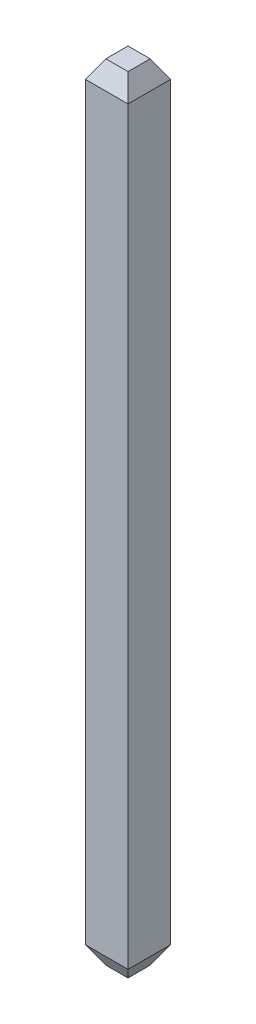
ISO-10303-21;
HEADER;
FILE_DESCRIPTION(('STEP AP214'),'2;1');
FILE_NAME('part.step','',(''),(''),'','','');
FILE_SCHEMA(('AUTOMOTIVE_DESIGN { 1 0 10303 214 1 1 1 1 }'));
ENDSEC;
DATA;
#1=APPLICATION_CONTEXT('core data for automotive mechanical design processes');
#2=APPLICATION_PROTOCOL_DEFINITION('international standard','automotive_design',2000,#1);
#3=PRODUCT_CONTEXT('',#1,'mechanical');
#4=PRODUCT('Part','Part','',(#3));
#5=PRODUCT_RELATED_PRODUCT_CATEGORY('part','',(#4));
#6=PRODUCT_DEFINITION_FORMATION('','',#4);
#7=PRODUCT_DEFINITION_CONTEXT('part definition',#1,'design');
#8=PRODUCT_DEFINITION('design','',#6,#7);
#9=PRODUCT_DEFINITION_SHAPE('','',#8);
#10=(LENGTH_UNIT() NAMED_UNIT(*) SI_UNIT(.MILLI.,.METRE.));
#11=(NAMED_UNIT(*) PLANE_ANGLE_UNIT() SI_UNIT($,.RADIAN.));
#12=(NAMED_UNIT(*) SI_UNIT($,.STERADIAN.) SOLID_ANGLE_UNIT());
#13=UNCERTAINTY_MEASURE_WITH_UNIT(LENGTH_MEASURE(1.E-05),#10,'distance_accuracy_value','');
#14=(GEOMETRIC_REPRESENTATION_CONTEXT(3) GLOBAL_UNCERTAINTY_ASSIGNED_CONTEXT((#13)) GLOBAL_UNIT_ASSIGNED_CONTEXT((#10,
#11,#12)) REPRESENTATION_CONTEXT('',''));
#15=CARTESIAN_POINT('',(0.,0.,0.));
#16=DIRECTION('',(0.,0.,1.));
#17=DIRECTION('',(1.,0.,0.));
#18=AXIS2_PLACEMENT_3D('',#15,#16,#17);
#19=CARTESIAN_POINT('',(7.3025,-5.58,1.105));
#20=DIRECTION('',(0.,0.50000000000019,0.866025403784329));
#21=DIRECTION('',(1.,0.,0.));
#22=AXIS2_PLACEMENT_3D('',#19,#20,#21);
#23=PLANE('',#22);
#24=DIRECTION('',(-0.44721359550015,0.774596669241261,-0.44721359550015));
#25=VECTOR('',#24,1.);
#26=CARTESIAN_POINT('',(7.455,-5.58,1.105));
#27=LINE('',#26,#25);
#28=CARTESIAN_POINT('',(7.455,-5.58,1.105));
#29=VERTEX_POINT('',#28);
#30=CARTESIAN_POINT('',(7.3025,-5.31586225185,0.9525));
#31=VERTEX_POINT('',#30);
#32=EDGE_CURVE('E91',#29,#31,#27,.T.);
#33=ORIENTED_EDGE('',*,*,#32,.T.);
#34=DIRECTION('',(1.,0.,0.));
#35=VECTOR('',#34,1.);
#36=CARTESIAN_POINT('',(7.3025,-5.31586225185,0.9525));
#37=LINE('',#36,#35);
#38=CARTESIAN_POINT('',(7.9375,-5.31586225185,0.9525));
#39=VERTEX_POINT('',#38);
#40=EDGE_CURVE('E94',#31,#39,#37,.T.);
#41=ORIENTED_EDGE('',*,*,#40,.T.);
#42=DIRECTION('',(0.44721359550015,0.774596669241261,-0.44721359550015));
#43=VECTOR('',#42,1.);
#44=CARTESIAN_POINT('',(7.785,-5.58,1.105));
#45=LINE('',#44,#43);
#46=CARTESIAN_POINT('',(7.785,-5.58,1.105));
#47=VERTEX_POINT('',#46);
#48=EDGE_CURVE('E27',#47,#39,#45,.T.);
#49=ORIENTED_EDGE('',*,*,#48,.F.);
#50=DIRECTION('',(1.,0.,0.));
#51=VECTOR('',#50,1.);
#52=CARTESIAN_POINT('',(7.455,-5.58,1.105));
#53=LINE('',#52,#51);
#54=EDGE_CURVE('E97',#29,#47,#53,.T.);
#55=ORIENTED_EDGE('',*,*,#54,.F.);
#56=EDGE_LOOP('',(#33,#41,#49,#55));
#57=FACE_BOUND('',#56,.T.);
#58=ADVANCED_FACE('F16',(#57),#23,.F.);
#59=CARTESIAN_POINT('',(7.9375,-5.58,1.435));
#60=DIRECTION('',(0.,0.50000000000019,-0.866025403784329));
#61=DIRECTION('',(-1.,0.,0.));
#62=AXIS2_PLACEMENT_3D('',#59,#60,#61);
#63=PLANE('',#62);
#64=DIRECTION('',(0.44721359550015,0.774596669241261,0.44721359550015));
#65=VECTOR('',#64,1.);
#66=CARTESIAN_POINT('',(7.785,-5.58,1.435));
#67=LINE('',#66,#65);
#68=CARTESIAN_POINT('',(7.785,-5.58,1.435));
#69=VERTEX_POINT('',#68);
#70=CARTESIAN_POINT('',(7.9375,-5.31586225185,1.5875));
#71=VERTEX_POINT('',#70);
#72=EDGE_CURVE('E11',#69,#71,#67,.T.);
#73=ORIENTED_EDGE('',*,*,#72,.T.);
#74=DIRECTION('',(-1.,0.,0.));
#75=VECTOR('',#74,1.);
#76=CARTESIAN_POINT('',(7.9375,-5.31586225185,1.5875));
#77=LINE('',#76,#75);
#78=CARTESIAN_POINT('',(7.3025,-5.31586225185,1.5875));
#79=VERTEX_POINT('',#78);
#80=EDGE_CURVE('E136',#71,#79,#77,.T.);
#81=ORIENTED_EDGE('',*,*,#80,.T.);
#82=DIRECTION('',(-0.44721359550015,0.774596669241261,0.44721359550015));
#83=VECTOR('',#82,1.);
#84=CARTESIAN_POINT('',(7.455,-5.58,1.435));
#85=LINE('',#84,#83);
#86=CARTESIAN_POINT('',(7.455,-5.58,1.435));
#87=VERTEX_POINT('',#86);
#88=EDGE_CURVE('E103',#87,#79,#85,.T.);
#89=ORIENTED_EDGE('',*,*,#88,.F.);
#90=DIRECTION('',(-1.,0.,0.));
#91=VECTOR('',#90,1.);
#92=CARTESIAN_POINT('',(7.785,-5.58,1.435));
#93=LINE('',#92,#91);
#94=EDGE_CURVE('E157',#69,#87,#93,.T.);
#95=ORIENTED_EDGE('',*,*,#94,.F.);
#96=EDGE_LOOP('',(#73,#81,#89,#95));
#97=FACE_BOUND('',#96,.T.);
#98=ADVANCED_FACE('F255',(#97),#63,.F.);
#99=CARTESIAN_POINT('',(7.785,-5.58,0.9525));
#100=DIRECTION('',(-0.866025403784329,0.50000000000019,0.));
#101=DIRECTION('',(0.,0.,1.));
#102=AXIS2_PLACEMENT_3D('',#99,#100,#101);
#103=PLANE('',#102);
#104=ORIENTED_EDGE('',*,*,#48,.T.);
#105=DIRECTION('',(0.,0.,1.));
#106=VECTOR('',#105,1.);
#107=CARTESIAN_POINT('',(7.9375,-5.31586225185,0.9525));
#108=LINE('',#107,#106);
#109=EDGE_CURVE('E133',#39,#71,#108,.T.);
#110=ORIENTED_EDGE('',*,*,#109,.T.);
#111=ORIENTED_EDGE('',*,*,#72,.F.);
#112=DIRECTION('',(0.,0.,1.));
#113=VECTOR('',#112,1.);
#114=CARTESIAN_POINT('',(7.785,-5.58,1.105));
#115=LINE('',#114,#113);
#116=EDGE_CURVE('E143',#47,#69,#115,.T.);
#117=ORIENTED_EDGE('',*,*,#116,.F.);
#118=EDGE_LOOP('',(#104,#110,#111,#117));
#119=FACE_BOUND('',#118,.T.);
#120=ADVANCED_FACE('F249',(#119),#103,.F.);
#121=CARTESIAN_POINT('',(7.62,-5.58,1.27));
#122=DIRECTION('',(0.,-1.,0.));
#123=DIRECTION('',(0.,0.,-1.));
#124=AXIS2_PLACEMENT_3D('',#121,#122,#123);
#125=PLANE('',#124);
#126=ORIENTED_EDGE('',*,*,#94,.T.);
#127=DIRECTION('',(0.,0.,-1.));
#128=VECTOR('',#127,1.);
#129=CARTESIAN_POINT('',(7.455,-5.58,1.435));
#130=LINE('',#129,#128);
#131=EDGE_CURVE('E102',#87,#29,#130,.T.);
#132=ORIENTED_EDGE('',*,*,#131,.T.);
#133=ORIENTED_EDGE('',*,*,#54,.T.);
#134=ORIENTED_EDGE('',*,*,#116,.T.);
#135=EDGE_LOOP('',(#126,#132,#133,#134));
#136=FACE_BOUND('',#135,.T.);
#137=ADVANCED_FACE('F254',(#136),#125,.T.);
#138=CARTESIAN_POINT('',(7.455,-5.58,1.5875));
#139=DIRECTION('',(0.866025403784329,0.50000000000019,0.));
#140=DIRECTION('',(0.,0.,-1.));
#141=AXIS2_PLACEMENT_3D('',#138,#139,#140);
#142=PLANE('',#141);
#143=ORIENTED_EDGE('',*,*,#88,.T.);
#144=DIRECTION('',(0.,0.,-1.));
#145=VECTOR('',#144,1.);
#146=CARTESIAN_POINT('',(7.3025,-5.31586225185,1.5875));
#147=LINE('',#146,#145);
#148=EDGE_CURVE('E106',#79,#31,#147,.T.);
#149=ORIENTED_EDGE('',*,*,#148,.T.);
#150=ORIENTED_EDGE('',*,*,#32,.F.);
#151=ORIENTED_EDGE('',*,*,#131,.F.);
#152=EDGE_LOOP('',(#143,#149,#150,#151));
#153=FACE_BOUND('',#152,.T.);
#154=ADVANCED_FACE('F108',(#153),#142,.F.);
#155=CARTESIAN_POINT('',(7.3025,6.1,1.5875));
#156=DIRECTION('',(-1.,0.,0.));
#157=DIRECTION('',(0.,0.,1.));
#158=AXIS2_PLACEMENT_3D('',#155,#156,#157);
#159=PLANE('',#158);
#160=DIRECTION('',(0.,-1.,0.));
#161=VECTOR('',#160,1.);
#162=CARTESIAN_POINT('',(7.3025,5.835862251846,0.9525));
#163=LINE('',#162,#161);
#164=CARTESIAN_POINT('',(7.3025,5.835862251846,0.9525));
#165=VERTEX_POINT('',#164);
#166=EDGE_CURVE('E113',#165,#31,#163,.T.);
#167=ORIENTED_EDGE('',*,*,#166,.T.);
#168=ORIENTED_EDGE('',*,*,#148,.F.);
#169=DIRECTION('',(0.,-1.,0.));
#170=VECTOR('',#169,1.);
#171=CARTESIAN_POINT('',(7.3025,5.835862251846,1.5875));
#172=LINE('',#171,#170);
#173=CARTESIAN_POINT('',(7.3025,5.835862251846,1.5875));
#174=VERTEX_POINT('',#173);
#175=EDGE_CURVE('E140',#174,#79,#172,.T.);
#176=ORIENTED_EDGE('',*,*,#175,.F.);
#177=DIRECTION('',(0.,0.,-1.));
#178=VECTOR('',#177,1.);
#179=CARTESIAN_POINT('',(7.3025,5.835862251846,1.5875));
#180=LINE('',#179,#178);
#181=EDGE_CURVE('E118',#174,#165,#180,.T.);
#182=ORIENTED_EDGE('',*,*,#181,.T.);
#183=EDGE_LOOP('',(#167,#168,#176,#182));
#184=FACE_BOUND('',#183,.T.);
#185=ADVANCED_FACE('F116',(#184),#159,.T.);
#186=CARTESIAN_POINT('',(7.3025,6.1,0.9525));
#187=DIRECTION('',(0.,0.,-1.));
#188=DIRECTION('',(0.,-1.,0.));
#189=AXIS2_PLACEMENT_3D('',#186,#187,#188);
#190=PLANE('',#189);
#191=DIRECTION('',(0.,-1.,0.));
#192=VECTOR('',#191,1.);
#193=CARTESIAN_POINT('',(7.9375,5.835862251846,0.9525));
#194=LINE('',#193,#192);
#195=CARTESIAN_POINT('',(7.9375,5.835862251846,0.9525));
#196=VERTEX_POINT('',#195);
#197=EDGE_CURVE('E20',#196,#39,#194,.T.);
#198=ORIENTED_EDGE('',*,*,#197,.T.);
#199=ORIENTED_EDGE('',*,*,#40,.F.);
#200=ORIENTED_EDGE('',*,*,#166,.F.);
#201=DIRECTION('',(1.,0.,0.));
#202=VECTOR('',#201,1.);
#203=CARTESIAN_POINT('',(7.3025,5.835862251846,0.9525));
#204=LINE('',#203,#202);
#205=EDGE_CURVE('E150',#165,#196,#204,.T.);
#206=ORIENTED_EDGE('',*,*,#205,.T.);
#207=EDGE_LOOP('',(#198,#199,#200,#206));
#208=FACE_BOUND('',#207,.T.);
#209=ADVANCED_FACE('F124',(#208),#190,.T.);
#210=CARTESIAN_POINT('',(7.9375,6.1,0.9525));
#211=DIRECTION('',(1.,0.,0.));
#212=DIRECTION('',(0.,1.,0.));
#213=AXIS2_PLACEMENT_3D('',#210,#211,#212);
#214=PLANE('',#213);
#215=DIRECTION('',(0.,-1.,0.));
#216=VECTOR('',#215,1.);
#217=CARTESIAN_POINT('',(7.9375,5.835862251846,1.5875));
#218=LINE('',#217,#216);
#219=CARTESIAN_POINT('',(7.9375,5.835862251846,1.5875));
#220=VERTEX_POINT('',#219);
#221=EDGE_CURVE('E139',#220,#71,#218,.T.);
#222=ORIENTED_EDGE('',*,*,#221,.T.);
#223=ORIENTED_EDGE('',*,*,#109,.F.);
#224=ORIENTED_EDGE('',*,*,#197,.F.);
#225=DIRECTION('',(0.,0.,1.));
#226=VECTOR('',#225,1.);
#227=CARTESIAN_POINT('',(7.9375,5.835862251846,0.9525));
#228=LINE('',#227,#226);
#229=EDGE_CURVE('E147',#196,#220,#228,.T.);
#230=ORIENTED_EDGE('',*,*,#229,.T.);
#231=EDGE_LOOP('',(#222,#223,#224,#230));
#232=FACE_BOUND('',#231,.T.);
#233=ADVANCED_FACE('F211',(#232),#214,.T.);
#234=CARTESIAN_POINT('',(7.9375,6.1,1.5875));
#235=DIRECTION('',(0.,0.,1.));
#236=DIRECTION('',(1.,0.,0.));
#237=AXIS2_PLACEMENT_3D('',#234,#235,#236);
#238=PLANE('',#237);
#239=ORIENTED_EDGE('',*,*,#175,.T.);
#240=ORIENTED_EDGE('',*,*,#80,.F.);
#241=ORIENTED_EDGE('',*,*,#221,.F.);
#242=DIRECTION('',(-1.,0.,0.));
#243=VECTOR('',#242,1.);
#244=CARTESIAN_POINT('',(7.9375,5.835862251846,1.5875));
#245=LINE('',#244,#243);
#246=EDGE_CURVE('E166',#220,#174,#245,.T.);
#247=ORIENTED_EDGE('',*,*,#246,.T.);
#248=EDGE_LOOP('',(#239,#240,#241,#247));
#249=FACE_BOUND('',#248,.T.);
#250=ADVANCED_FACE('F18',(#249),#238,.T.);
#251=CARTESIAN_POINT('',(7.9375,6.1,1.435));
#252=DIRECTION('',(0.,0.50000000000019,0.866025403784329));
#253=DIRECTION('',(1.,0.,0.));
#254=AXIS2_PLACEMENT_3D('',#251,#252,#253);
#255=PLANE('',#254);
#256=DIRECTION('',(-0.44721359550015,-0.774596669241261,0.44721359550015));
#257=VECTOR('',#256,1.);
#258=CARTESIAN_POINT('',(7.455,6.1,1.435));
#259=LINE('',#258,#257);
#260=CARTESIAN_POINT('',(7.455,6.1,1.435));
#261=VERTEX_POINT('',#260);
#262=EDGE_CURVE('E165',#261,#174,#259,.T.);
#263=ORIENTED_EDGE('',*,*,#262,.T.);
#264=ORIENTED_EDGE('',*,*,#246,.F.);
#265=DIRECTION('',(0.44721359550015,-0.774596669241261,0.44721359550015));
#266=VECTOR('',#265,1.);
#267=CARTESIAN_POINT('',(7.785,6.1,1.435));
#268=LINE('',#267,#266);
#269=CARTESIAN_POINT('',(7.785,6.1,1.435));
#270=VERTEX_POINT('',#269);
#271=EDGE_CURVE('E144',#270,#220,#268,.T.);
#272=ORIENTED_EDGE('',*,*,#271,.F.);
#273=DIRECTION('',(-1.,0.,0.));
#274=VECTOR('',#273,1.);
#275=CARTESIAN_POINT('',(7.785,6.1,1.435));
#276=LINE('',#275,#274);
#277=EDGE_CURVE('E185',#270,#261,#276,.T.);
#278=ORIENTED_EDGE('',*,*,#277,.T.);
#279=EDGE_LOOP('',(#263,#264,#272,#278));
#280=FACE_BOUND('',#279,.T.);
#281=ADVANCED_FACE('F227',(#280),#255,.T.);
#282=CARTESIAN_POINT('',(7.455,6.1,1.5875));
#283=DIRECTION('',(-0.866025403784329,0.50000000000019,0.));
#284=DIRECTION('',(0.,0.,1.));
#285=AXIS2_PLACEMENT_3D('',#282,#283,#284);
#286=PLANE('',#285);
#287=DIRECTION('',(-0.44721359550015,-0.774596669241261,-0.44721359550015));
#288=VECTOR('',#287,1.);
#289=CARTESIAN_POINT('',(7.455,6.1,1.105));
#290=LINE('',#289,#288);
#291=CARTESIAN_POINT('',(7.455,6.1,1.105));
#292=VERTEX_POINT('',#291);
#293=EDGE_CURVE('E152',#292,#165,#290,.T.);
#294=ORIENTED_EDGE('',*,*,#293,.T.);
#295=ORIENTED_EDGE('',*,*,#181,.F.);
#296=ORIENTED_EDGE('',*,*,#262,.F.);
#297=DIRECTION('',(0.,0.,-1.));
#298=VECTOR('',#297,1.);
#299=CARTESIAN_POINT('',(7.455,6.1,1.435));
#300=LINE('',#299,#298);
#301=EDGE_CURVE('E190',#261,#292,#300,.T.);
#302=ORIENTED_EDGE('',*,*,#301,.T.);
#303=EDGE_LOOP('',(#294,#295,#296,#302));
#304=FACE_BOUND('',#303,.T.);
#305=ADVANCED_FACE('F231',(#304),#286,.T.);
#306=CARTESIAN_POINT('',(7.3025,6.1,1.105));
#307=DIRECTION('',(0.,0.50000000000019,-0.866025403784329));
#308=DIRECTION('',(-1.,0.,0.));
#309=AXIS2_PLACEMENT_3D('',#306,#307,#308);
#310=PLANE('',#309);
#311=DIRECTION('',(0.44721359550015,-0.774596669241261,-0.44721359550015));
#312=VECTOR('',#311,1.);
#313=CARTESIAN_POINT('',(7.785,6.1,1.105));
#314=LINE('',#313,#312);
#315=CARTESIAN_POINT('',(7.785,6.1,1.105));
#316=VERTEX_POINT('',#315);
#317=EDGE_CURVE('E153',#316,#196,#314,.T.);
#318=ORIENTED_EDGE('',*,*,#317,.T.);
#319=ORIENTED_EDGE('',*,*,#205,.F.);
#320=ORIENTED_EDGE('',*,*,#293,.F.);
#321=DIRECTION('',(1.,0.,0.));
#322=VECTOR('',#321,1.);
#323=CARTESIAN_POINT('',(7.455,6.1,1.105));
#324=LINE('',#323,#322);
#325=EDGE_CURVE('E186',#292,#316,#324,.T.);
#326=ORIENTED_EDGE('',*,*,#325,.T.);
#327=EDGE_LOOP('',(#318,#319,#320,#326));
#328=FACE_BOUND('',#327,.T.);
#329=ADVANCED_FACE('F203',(#328),#310,.T.);
#330=CARTESIAN_POINT('',(7.785,6.1,0.9525));
#331=DIRECTION('',(0.866025403784329,0.50000000000019,0.));
#332=DIRECTION('',(0.,0.,-1.));
#333=AXIS2_PLACEMENT_3D('',#330,#331,#332);
#334=PLANE('',#333);
#335=ORIENTED_EDGE('',*,*,#271,.T.);
#336=ORIENTED_EDGE('',*,*,#229,.F.);
#337=ORIENTED_EDGE('',*,*,#317,.F.);
#338=DIRECTION('',(0.,0.,1.));
#339=VECTOR('',#338,1.);
#340=CARTESIAN_POINT('',(7.785,6.1,1.105));
#341=LINE('',#340,#339);
#342=EDGE_CURVE('E148',#316,#270,#341,.T.);
#343=ORIENTED_EDGE('',*,*,#342,.T.);
#344=EDGE_LOOP('',(#335,#336,#337,#343));
#345=FACE_BOUND('',#344,.T.);
#346=ADVANCED_FACE('F207',(#345),#334,.T.);
#347=CARTESIAN_POINT('',(7.62,6.1,1.27));
#348=DIRECTION('',(0.,-1.,0.));
#349=DIRECTION('',(0.,0.,-1.));
#350=AXIS2_PLACEMENT_3D('',#347,#348,#349);
#351=PLANE('',#350);
#352=ORIENTED_EDGE('',*,*,#325,.F.);
#353=ORIENTED_EDGE('',*,*,#301,.F.);
#354=ORIENTED_EDGE('',*,*,#277,.F.);
#355=ORIENTED_EDGE('',*,*,#342,.F.);
#356=EDGE_LOOP('',(#352,#353,#354,#355));
#357=FACE_BOUND('',#356,.T.);
#358=ADVANCED_FACE('F233',(#357),#351,.F.);
#359=CLOSED_SHELL('',(#58,#98,#120,#137,#154,#185,#209,#233,#250,#281,#305,#329,#346,#358));
#360=MANIFOLD_SOLID_BREP('B1',#359);
#361=ADVANCED_BREP_SHAPE_REPRESENTATION('',(#18,#360),#14);
#362=SHAPE_DEFINITION_REPRESENTATION(#9,#361);
ENDSEC;
END-ISO-10303-21;
